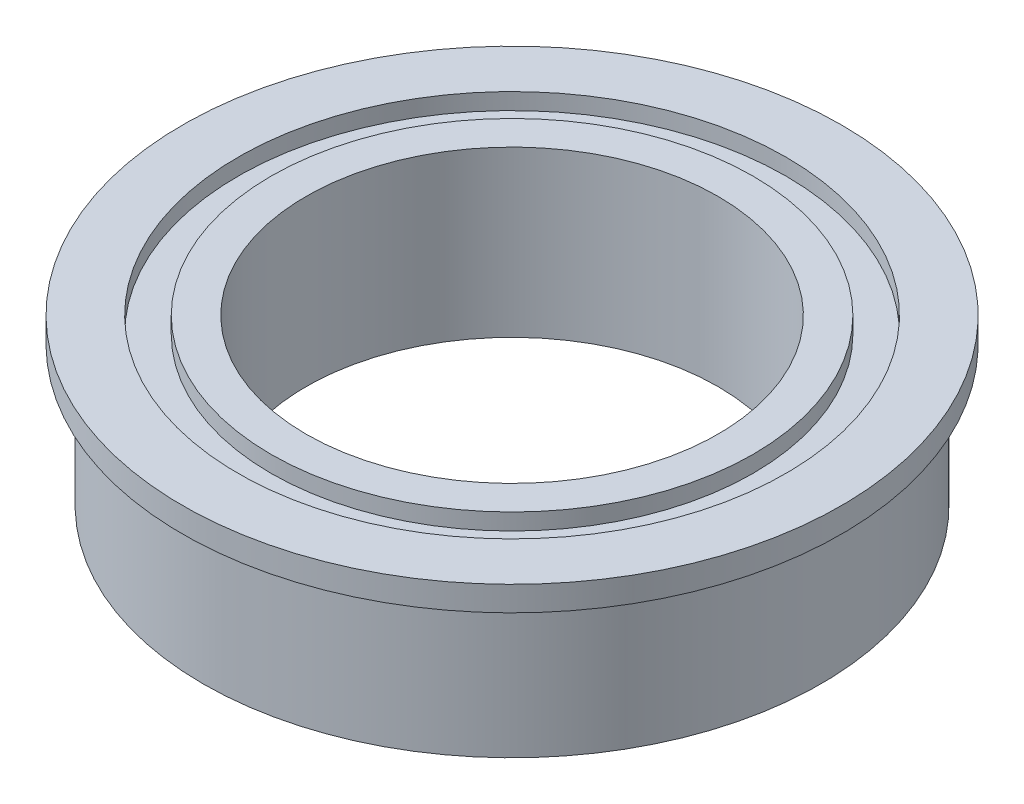
ISO-10303-21;
HEADER;
FILE_DESCRIPTION(('STEP AP214'),'2;1');
FILE_NAME('part.step','',(''),(''),'','','');
FILE_SCHEMA(('AUTOMOTIVE_DESIGN { 1 0 10303 214 1 1 1 1 }'));
ENDSEC;
DATA;
#1=APPLICATION_CONTEXT('core data for automotive mechanical design processes');
#2=APPLICATION_PROTOCOL_DEFINITION('international standard','automotive_design',2000,#1);
#3=PRODUCT_CONTEXT('',#1,'mechanical');
#4=PRODUCT('Part','Part','',(#3));
#5=PRODUCT_RELATED_PRODUCT_CATEGORY('part','',(#4));
#6=PRODUCT_DEFINITION_FORMATION('','',#4);
#7=PRODUCT_DEFINITION_CONTEXT('part definition',#1,'design');
#8=PRODUCT_DEFINITION('design','',#6,#7);
#9=PRODUCT_DEFINITION_SHAPE('','',#8);
#10=(LENGTH_UNIT() NAMED_UNIT(*) SI_UNIT(.MILLI.,.METRE.));
#11=(NAMED_UNIT(*) PLANE_ANGLE_UNIT() SI_UNIT($,.RADIAN.));
#12=(NAMED_UNIT(*) SI_UNIT($,.STERADIAN.) SOLID_ANGLE_UNIT());
#13=UNCERTAINTY_MEASURE_WITH_UNIT(LENGTH_MEASURE(1.E-05),#10,'distance_accuracy_value','');
#14=(GEOMETRIC_REPRESENTATION_CONTEXT(3) GLOBAL_UNCERTAINTY_ASSIGNED_CONTEXT((#13)) GLOBAL_UNIT_ASSIGNED_CONTEXT((#10,
#11,#12)) REPRESENTATION_CONTEXT('',''));
#15=CARTESIAN_POINT('',(0.,0.,0.));
#16=DIRECTION('',(0.,0.,1.));
#17=DIRECTION('',(1.,0.,0.));
#18=AXIS2_PLACEMENT_3D('',#15,#16,#17);
#19=CARTESIAN_POINT('',(5.85,0.599999999999996,0.));
#20=DIRECTION('',(0.,1.,0.));
#21=DIRECTION('',(0.,0.,1.));
#22=AXIS2_PLACEMENT_3D('',#19,#20,#21);
#23=PLANE('',#22);
#24=CARTESIAN_POINT('',(0.,0.599999999999996,0.));
#25=DIRECTION('',(0.,-1.,0.));
#26=DIRECTION('',(0.,0.,-1.));
#27=AXIS2_PLACEMENT_3D('',#24,#25,#26);
#28=CIRCLE('',#27,5.);
#29=CARTESIAN_POINT('',(0.,0.599999999999996,-5.));
#30=VERTEX_POINT('',#29);
#31=EDGE_CURVE('E10',#30,#30,#28,.T.);
#32=ORIENTED_EDGE('',*,*,#31,.T.);
#33=EDGE_LOOP('',(#32));
#34=FACE_BOUND('',#33,.T.);
#35=CARTESIAN_POINT('',(0.,0.599999999999996,0.));
#36=DIRECTION('',(0.,-1.,0.));
#37=DIRECTION('',(0.,0.,-1.));
#38=AXIS2_PLACEMENT_3D('',#35,#36,#37);
#39=CIRCLE('',#38,5.85);
#40=CARTESIAN_POINT('',(0.,0.599999999999996,-5.85));
#41=VERTEX_POINT('',#40);
#42=EDGE_CURVE('E75',#41,#41,#39,.T.);
#43=ORIENTED_EDGE('',*,*,#42,.F.);
#44=EDGE_LOOP('',(#43));
#45=FACE_BOUND('',#44,.T.);
#46=ADVANCED_FACE('F29',(#34,#45),#23,.T.);
#47=CARTESIAN_POINT('',(0.,0.,0.));
#48=DIRECTION('',(0.,-1.,0.));
#49=DIRECTION('',(0.,0.,-1.));
#50=AXIS2_PLACEMENT_3D('',#47,#48,#49);
#51=CYLINDRICAL_SURFACE('',#50,5.);
#52=CARTESIAN_POINT('',(0.,-3.4,0.));
#53=DIRECTION('',(0.,-1.,0.));
#54=DIRECTION('',(0.,0.,-1.));
#55=AXIS2_PLACEMENT_3D('',#52,#53,#54);
#56=CIRCLE('',#55,5.);
#57=CARTESIAN_POINT('',(0.,-3.4,-5.));
#58=VERTEX_POINT('',#57);
#59=EDGE_CURVE('E35',#58,#58,#56,.T.);
#60=ORIENTED_EDGE('',*,*,#59,.T.);
#61=EDGE_LOOP('',(#60));
#62=FACE_BOUND('',#61,.T.);
#63=ORIENTED_EDGE('',*,*,#31,.F.);
#64=EDGE_LOOP('',(#63));
#65=FACE_BOUND('',#64,.T.);
#66=ADVANCED_FACE('F83',(#62,#65),#51,.F.);
#67=CARTESIAN_POINT('',(5.,-3.4,0.));
#68=DIRECTION('',(0.,-1.,0.));
#69=DIRECTION('',(0.,0.,-1.));
#70=AXIS2_PLACEMENT_3D('',#67,#68,#69);
#71=PLANE('',#70);
#72=CARTESIAN_POINT('',(0.,-3.4,0.));
#73=DIRECTION('',(0.,-1.,0.));
#74=DIRECTION('',(0.,0.,-1.));
#75=AXIS2_PLACEMENT_3D('',#72,#73,#74);
#76=CIRCLE('',#75,5.85);
#77=CARTESIAN_POINT('',(0.,-3.4,-5.85));
#78=VERTEX_POINT('',#77);
#79=EDGE_CURVE('E39',#78,#78,#76,.T.);
#80=ORIENTED_EDGE('',*,*,#79,.T.);
#81=EDGE_LOOP('',(#80));
#82=FACE_BOUND('',#81,.T.);
#83=ORIENTED_EDGE('',*,*,#59,.F.);
#84=EDGE_LOOP('',(#83));
#85=FACE_BOUND('',#84,.T.);
#86=ADVANCED_FACE('F87',(#82,#85),#71,.T.);
#87=CARTESIAN_POINT('',(0.,0.,0.));
#88=DIRECTION('',(0.,-1.,0.));
#89=DIRECTION('',(0.,0.,-1.));
#90=AXIS2_PLACEMENT_3D('',#87,#88,#89);
#91=CYLINDRICAL_SURFACE('',#90,5.85);
#92=CARTESIAN_POINT('',(0.,-3.,0.));
#93=DIRECTION('',(0.,-1.,0.));
#94=DIRECTION('',(0.,0.,-1.));
#95=AXIS2_PLACEMENT_3D('',#92,#93,#94);
#96=CIRCLE('',#95,5.85);
#97=CARTESIAN_POINT('',(0.,-3.,-5.85));
#98=VERTEX_POINT('',#97);
#99=EDGE_CURVE('E43',#98,#98,#96,.T.);
#100=ORIENTED_EDGE('',*,*,#99,.T.);
#101=EDGE_LOOP('',(#100));
#102=FACE_BOUND('',#101,.T.);
#103=ORIENTED_EDGE('',*,*,#79,.F.);
#104=EDGE_LOOP('',(#103));
#105=FACE_BOUND('',#104,.T.);
#106=ADVANCED_FACE('F91',(#102,#105),#91,.T.);
#107=CARTESIAN_POINT('',(5.85,-3.,0.));
#108=DIRECTION('',(0.,-1.,0.));
#109=DIRECTION('',(0.,0.,-1.));
#110=AXIS2_PLACEMENT_3D('',#107,#108,#109);
#111=PLANE('',#110);
#112=CARTESIAN_POINT('',(0.,-3.,0.));
#113=DIRECTION('',(0.,-1.,0.));
#114=DIRECTION('',(0.,0.,-1.));
#115=AXIS2_PLACEMENT_3D('',#112,#113,#114);
#116=CIRCLE('',#115,6.65);
#117=CARTESIAN_POINT('',(0.,-3.,-6.65));
#118=VERTEX_POINT('',#117);
#119=EDGE_CURVE('E48',#118,#118,#116,.T.);
#120=ORIENTED_EDGE('',*,*,#119,.T.);
#121=EDGE_LOOP('',(#120));
#122=FACE_BOUND('',#121,.T.);
#123=ORIENTED_EDGE('',*,*,#99,.F.);
#124=EDGE_LOOP('',(#123));
#125=FACE_BOUND('',#124,.T.);
#126=ADVANCED_FACE('F98',(#122,#125),#111,.T.);
#127=CARTESIAN_POINT('',(0.,0.,0.));
#128=DIRECTION('',(0.,-1.,0.));
#129=DIRECTION('',(0.,0.,-1.));
#130=AXIS2_PLACEMENT_3D('',#127,#128,#129);
#131=CYLINDRICAL_SURFACE('',#130,6.65);
#132=CARTESIAN_POINT('',(0.,-3.4,0.));
#133=DIRECTION('',(0.,-1.,0.));
#134=DIRECTION('',(0.,0.,-1.));
#135=AXIS2_PLACEMENT_3D('',#132,#133,#134);
#136=CIRCLE('',#135,6.65);
#137=CARTESIAN_POINT('',(0.,-3.4,-6.65));
#138=VERTEX_POINT('',#137);
#139=EDGE_CURVE('E51',#138,#138,#136,.T.);
#140=ORIENTED_EDGE('',*,*,#139,.T.);
#141=EDGE_LOOP('',(#140));
#142=FACE_BOUND('',#141,.T.);
#143=ORIENTED_EDGE('',*,*,#119,.F.);
#144=EDGE_LOOP('',(#143));
#145=FACE_BOUND('',#144,.T.);
#146=ADVANCED_FACE('F102',(#142,#145),#131,.F.);
#147=CARTESIAN_POINT('',(6.65,-3.4,0.));
#148=DIRECTION('',(0.,-1.,0.));
#149=DIRECTION('',(0.,0.,-1.));
#150=AXIS2_PLACEMENT_3D('',#147,#148,#149);
#151=PLANE('',#150);
#152=CARTESIAN_POINT('',(0.,-3.4,0.));
#153=DIRECTION('',(0.,-1.,0.));
#154=DIRECTION('',(0.,0.,-1.));
#155=AXIS2_PLACEMENT_3D('',#152,#153,#154);
#156=CIRCLE('',#155,7.5);
#157=CARTESIAN_POINT('',(0.,-3.4,-7.5));
#158=VERTEX_POINT('',#157);
#159=EDGE_CURVE('E54',#158,#158,#156,.T.);
#160=ORIENTED_EDGE('',*,*,#159,.T.);
#161=EDGE_LOOP('',(#160));
#162=FACE_BOUND('',#161,.T.);
#163=ORIENTED_EDGE('',*,*,#139,.F.);
#164=EDGE_LOOP('',(#163));
#165=FACE_BOUND('',#164,.T.);
#166=ADVANCED_FACE('F106',(#162,#165),#151,.T.);
#167=CARTESIAN_POINT('',(0.,0.,0.));
#168=DIRECTION('',(0.,-1.,0.));
#169=DIRECTION('',(0.,0.,-1.));
#170=AXIS2_PLACEMENT_3D('',#167,#168,#169);
#171=CYLINDRICAL_SURFACE('',#170,7.5);
#172=CARTESIAN_POINT('',(0.,0.,0.));
#173=DIRECTION('',(0.,-1.,0.));
#174=DIRECTION('',(0.,0.,-1.));
#175=AXIS2_PLACEMENT_3D('',#172,#173,#174);
#176=CIRCLE('',#175,7.5);
#177=CARTESIAN_POINT('',(0.,0.,-7.5));
#178=VERTEX_POINT('',#177);
#179=EDGE_CURVE('E57',#178,#178,#176,.T.);
#180=ORIENTED_EDGE('',*,*,#179,.T.);
#181=EDGE_LOOP('',(#180));
#182=FACE_BOUND('',#181,.T.);
#183=ORIENTED_EDGE('',*,*,#159,.F.);
#184=EDGE_LOOP('',(#183));
#185=FACE_BOUND('',#184,.T.);
#186=ADVANCED_FACE('F110',(#182,#185),#171,.T.);
#187=CARTESIAN_POINT('',(7.5,0.,0.));
#188=DIRECTION('',(0.,-1.,0.));
#189=DIRECTION('',(0.,0.,-1.));
#190=AXIS2_PLACEMENT_3D('',#187,#188,#189);
#191=PLANE('',#190);
#192=CARTESIAN_POINT('',(0.,0.,0.));
#193=DIRECTION('',(0.,-1.,0.));
#194=DIRECTION('',(0.,0.,-1.));
#195=AXIS2_PLACEMENT_3D('',#192,#193,#194);
#196=CIRCLE('',#195,8.);
#197=CARTESIAN_POINT('',(0.,0.,-8.));
#198=VERTEX_POINT('',#197);
#199=EDGE_CURVE('E60',#198,#198,#196,.T.);
#200=ORIENTED_EDGE('',*,*,#199,.T.);
#201=EDGE_LOOP('',(#200));
#202=FACE_BOUND('',#201,.T.);
#203=ORIENTED_EDGE('',*,*,#179,.F.);
#204=EDGE_LOOP('',(#203));
#205=FACE_BOUND('',#204,.T.);
#206=ADVANCED_FACE('F114',(#202,#205),#191,.T.);
#207=CARTESIAN_POINT('',(0.,0.,0.));
#208=DIRECTION('',(0.,-1.,0.));
#209=DIRECTION('',(0.,0.,-1.));
#210=AXIS2_PLACEMENT_3D('',#207,#208,#209);
#211=CYLINDRICAL_SURFACE('',#210,8.);
#212=CARTESIAN_POINT('',(0.,0.6,0.));
#213=DIRECTION('',(0.,-1.,0.));
#214=DIRECTION('',(0.,0.,-1.));
#215=AXIS2_PLACEMENT_3D('',#212,#213,#214);
#216=CIRCLE('',#215,8.);
#217=CARTESIAN_POINT('',(0.,0.6,-8.));
#218=VERTEX_POINT('',#217);
#219=EDGE_CURVE('E63',#218,#218,#216,.T.);
#220=ORIENTED_EDGE('',*,*,#219,.T.);
#221=EDGE_LOOP('',(#220));
#222=FACE_BOUND('',#221,.T.);
#223=ORIENTED_EDGE('',*,*,#199,.F.);
#224=EDGE_LOOP('',(#223));
#225=FACE_BOUND('',#224,.T.);
#226=ADVANCED_FACE('F118',(#222,#225),#211,.T.);
#227=CARTESIAN_POINT('',(8.,0.599999999999998,0.));
#228=DIRECTION('',(0.,1.,0.));
#229=DIRECTION('',(0.,0.,1.));
#230=AXIS2_PLACEMENT_3D('',#227,#228,#229);
#231=PLANE('',#230);
#232=CARTESIAN_POINT('',(0.,0.599999999999996,0.));
#233=DIRECTION('',(0.,-1.,0.));
#234=DIRECTION('',(0.,0.,-1.));
#235=AXIS2_PLACEMENT_3D('',#232,#233,#234);
#236=CIRCLE('',#235,6.65);
#237=CARTESIAN_POINT('',(0.,0.599999999999996,-6.65));
#238=VERTEX_POINT('',#237);
#239=EDGE_CURVE('E66',#238,#238,#236,.T.);
#240=ORIENTED_EDGE('',*,*,#239,.T.);
#241=EDGE_LOOP('',(#240));
#242=FACE_BOUND('',#241,.T.);
#243=ORIENTED_EDGE('',*,*,#219,.F.);
#244=EDGE_LOOP('',(#243));
#245=FACE_BOUND('',#244,.T.);
#246=ADVANCED_FACE('F122',(#242,#245),#231,.T.);
#247=CARTESIAN_POINT('',(0.,0.,0.));
#248=DIRECTION('',(0.,-1.,0.));
#249=DIRECTION('',(0.,0.,-1.));
#250=AXIS2_PLACEMENT_3D('',#247,#248,#249);
#251=CYLINDRICAL_SURFACE('',#250,6.65);
#252=CARTESIAN_POINT('',(0.,0.2,0.));
#253=DIRECTION('',(0.,-1.,0.));
#254=DIRECTION('',(0.,0.,-1.));
#255=AXIS2_PLACEMENT_3D('',#252,#253,#254);
#256=CIRCLE('',#255,6.65);
#257=CARTESIAN_POINT('',(0.,0.2,-6.65));
#258=VERTEX_POINT('',#257);
#259=EDGE_CURVE('E69',#258,#258,#256,.T.);
#260=ORIENTED_EDGE('',*,*,#259,.T.);
#261=EDGE_LOOP('',(#260));
#262=FACE_BOUND('',#261,.T.);
#263=ORIENTED_EDGE('',*,*,#239,.F.);
#264=EDGE_LOOP('',(#263));
#265=FACE_BOUND('',#264,.T.);
#266=ADVANCED_FACE('F126',(#262,#265),#251,.F.);
#267=CARTESIAN_POINT('',(6.65,0.2,0.));
#268=DIRECTION('',(0.,1.,0.));
#269=DIRECTION('',(0.,0.,1.));
#270=AXIS2_PLACEMENT_3D('',#267,#268,#269);
#271=PLANE('',#270);
#272=CARTESIAN_POINT('',(0.,0.2,0.));
#273=DIRECTION('',(0.,-1.,0.));
#274=DIRECTION('',(0.,0.,-1.));
#275=AXIS2_PLACEMENT_3D('',#272,#273,#274);
#276=CIRCLE('',#275,5.85);
#277=CARTESIAN_POINT('',(0.,0.2,-5.85));
#278=VERTEX_POINT('',#277);
#279=EDGE_CURVE('E72',#278,#278,#276,.T.);
#280=ORIENTED_EDGE('',*,*,#279,.T.);
#281=EDGE_LOOP('',(#280));
#282=FACE_BOUND('',#281,.T.);
#283=ORIENTED_EDGE('',*,*,#259,.F.);
#284=EDGE_LOOP('',(#283));
#285=FACE_BOUND('',#284,.T.);
#286=ADVANCED_FACE('F130',(#282,#285),#271,.T.);
#287=CARTESIAN_POINT('',(0.,0.,0.));
#288=DIRECTION('',(0.,-1.,0.));
#289=DIRECTION('',(0.,0.,-1.));
#290=AXIS2_PLACEMENT_3D('',#287,#288,#289);
#291=CYLINDRICAL_SURFACE('',#290,5.85);
#292=ORIENTED_EDGE('',*,*,#42,.T.);
#293=EDGE_LOOP('',(#292));
#294=FACE_BOUND('',#293,.T.);
#295=ORIENTED_EDGE('',*,*,#279,.F.);
#296=EDGE_LOOP('',(#295));
#297=FACE_BOUND('',#296,.T.);
#298=ADVANCED_FACE('F79',(#294,#297),#291,.T.);
#299=CLOSED_SHELL('',(#46,#66,#86,#106,#126,#146,#166,#186,#206,#226,#246,#266,#286,#298));
#300=MANIFOLD_SOLID_BREP('B2',#299);
#301=ADVANCED_BREP_SHAPE_REPRESENTATION('',(#18,#300),#14);
#302=SHAPE_DEFINITION_REPRESENTATION(#9,#301);
ENDSEC;
END-ISO-10303-21;
